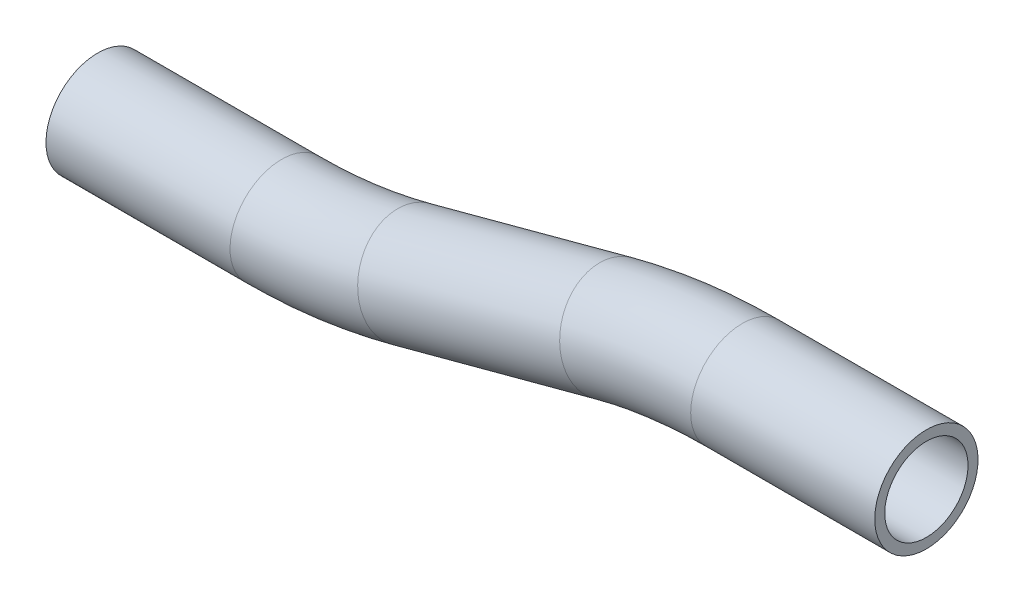
ISO-10303-21;
HEADER;
FILE_DESCRIPTION(('STEP AP214'),'2;1');
FILE_NAME('part.step','',(''),(''),'','','');
FILE_SCHEMA(('AUTOMOTIVE_DESIGN { 1 0 10303 214 1 1 1 1 }'));
ENDSEC;
DATA;
#1=APPLICATION_CONTEXT('core data for automotive mechanical design processes');
#2=APPLICATION_PROTOCOL_DEFINITION('international standard','automotive_design',2000,#1);
#3=PRODUCT_CONTEXT('',#1,'mechanical');
#4=PRODUCT('Part','Part','',(#3));
#5=PRODUCT_RELATED_PRODUCT_CATEGORY('part','',(#4));
#6=PRODUCT_DEFINITION_FORMATION('','',#4);
#7=PRODUCT_DEFINITION_CONTEXT('part definition',#1,'design');
#8=PRODUCT_DEFINITION('design','',#6,#7);
#9=PRODUCT_DEFINITION_SHAPE('','',#8);
#10=(LENGTH_UNIT() NAMED_UNIT(*) SI_UNIT(.MILLI.,.METRE.));
#11=(NAMED_UNIT(*) PLANE_ANGLE_UNIT() SI_UNIT($,.RADIAN.));
#12=(NAMED_UNIT(*) SI_UNIT($,.STERADIAN.) SOLID_ANGLE_UNIT());
#13=UNCERTAINTY_MEASURE_WITH_UNIT(LENGTH_MEASURE(1.E-05),#10,'distance_accuracy_value','');
#14=(GEOMETRIC_REPRESENTATION_CONTEXT(3) GLOBAL_UNCERTAINTY_ASSIGNED_CONTEXT((#13)) GLOBAL_UNIT_ASSIGNED_CONTEXT((#10,
#11,#12)) REPRESENTATION_CONTEXT('',''));
#15=CARTESIAN_POINT('',(0.,0.,0.));
#16=DIRECTION('',(0.,0.,1.));
#17=DIRECTION('',(1.,0.,0.));
#18=AXIS2_PLACEMENT_3D('',#15,#16,#17);
#19=CARTESIAN_POINT('',(28.0680796838404,0.,0.));
#20=DIRECTION('',(-1.,0.,0.));
#21=DIRECTION('',(0.,-1.,0.));
#22=AXIS2_PLACEMENT_3D('',#19,#20,#21);
#23=CYLINDRICAL_SURFACE('',#22,7.874);
#24=CARTESIAN_POINT('',(0.,0.,0.));
#25=DIRECTION('',(-1.,0.,0.));
#26=DIRECTION('',(0.,-1.,0.));
#27=AXIS2_PLACEMENT_3D('',#24,#25,#26);
#28=CIRCLE('',#27,7.874);
#29=CARTESIAN_POINT('',(0.,7.87399999999996,0.));
#30=VERTEX_POINT('',#29);
#31=EDGE_CURVE('E58',#30,#30,#28,.T.);
#32=ORIENTED_EDGE('',*,*,#31,.F.);
#33=EDGE_LOOP('',(#32));
#34=FACE_BOUND('',#33,.T.);
#35=CARTESIAN_POINT('',(28.0680796838404,0.,0.));
#36=DIRECTION('',(-1.,0.,0.));
#37=DIRECTION('',(0.,-1.,0.));
#38=AXIS2_PLACEMENT_3D('',#35,#36,#37);
#39=CIRCLE('',#38,7.874);
#40=CARTESIAN_POINT('',(28.0680796838404,-7.874,0.));
#41=VERTEX_POINT('',#40);
#42=EDGE_CURVE('E55',#41,#41,#39,.T.);
#43=ORIENTED_EDGE('',*,*,#42,.T.);
#44=EDGE_LOOP('',(#43));
#45=FACE_BOUND('',#44,.T.);
#46=ADVANCED_FACE('F34',(#34,#45),#23,.T.);
#47=CARTESIAN_POINT('',(0.,-76.2,0.));
#48=DIRECTION('',(0.,0.,1.));
#49=DIRECTION('',(1.,0.,0.));
#50=AXIS2_PLACEMENT_3D('',#47,#48,#49);
#51=TOROIDAL_SURFACE('',#50,76.2,7.874);
#52=CARTESIAN_POINT('',(-19.7220112368122,-2.59645203677303,0.));
#53=DIRECTION('',(-0.965925826289068,-0.258819045102522,0.));
#54=DIRECTION('',(0.258819045102522,-0.965925826289068,0.));
#55=AXIS2_PLACEMENT_3D('',#52,#53,#54);
#56=CIRCLE('',#55,7.874);
#57=CARTESIAN_POINT('',(-21.7599523979494,5.00924791942708,0.));
#58=VERTEX_POINT('',#57);
#59=EDGE_CURVE('E61',#58,#58,#56,.T.);
#60=CARTESIAN_POINT('',(0.,-76.2,0.));
#61=DIRECTION('',(0.,0.,1.));
#62=DIRECTION('',(1.,0.,0.));
#63=AXIS2_PLACEMENT_3D('',#60,#61,#62);
#64=CIRCLE('',#63,84.074);
#65=EDGE_CURVE('',#30,#58,#64,.T.);
#66=ORIENTED_EDGE('',*,*,#31,.T.);
#67=ORIENTED_EDGE('',*,*,#59,.F.);
#68=ORIENTED_EDGE('',*,*,#65,.T.);
#69=ORIENTED_EDGE('',*,*,#65,.F.);
#70=EDGE_LOOP('',(#66,#68,#67,#69));
#71=FACE_BOUND('',#70,.T.);
#72=ADVANCED_FACE('F80',(#71),#51,.T.);
#73=CARTESIAN_POINT('',(-19.7220112368122,-2.59645203677303,0.));
#74=DIRECTION('',(-0.965925826289068,-0.258819045102522,0.));
#75=DIRECTION('',(0.258819045102522,-0.965925826289068,0.));
#76=AXIS2_PLACEMENT_3D('',#73,#74,#75);
#77=CYLINDRICAL_SURFACE('',#76,7.874);
#78=CARTESIAN_POINT('',(-50.5239923613557,-10.8498180043732,0.));
#79=DIRECTION('',(-0.965925826289068,-0.258819045102522,0.));
#80=DIRECTION('',(0.258819045102522,-0.965925826289068,0.));
#81=AXIS2_PLACEMENT_3D('',#78,#79,#80);
#82=CIRCLE('',#81,7.874);
#83=CARTESIAN_POINT('',(-48.4860512002184,-18.4555179605733,0.));
#84=VERTEX_POINT('',#83);
#85=EDGE_CURVE('E63',#84,#84,#82,.T.);
#86=ORIENTED_EDGE('',*,*,#85,.F.);
#87=EDGE_LOOP('',(#86));
#88=FACE_BOUND('',#87,.T.);
#89=ORIENTED_EDGE('',*,*,#59,.T.);
#90=EDGE_LOOP('',(#89));
#91=FACE_BOUND('',#90,.T.);
#92=ADVANCED_FACE('F73',(#88,#91),#77,.T.);
#93=CARTESIAN_POINT('',(-70.2460035981678,62.7537299588538,0.));
#94=DIRECTION('',(0.,0.,-1.));
#95=DIRECTION('',(-1.,0.,0.));
#96=AXIS2_PLACEMENT_3D('',#93,#94,#95);
#97=TOROIDAL_SURFACE('',#96,76.2,7.874);
#98=CARTESIAN_POINT('',(-70.2460035981677,-13.4462700411462,0.));
#99=DIRECTION('',(-1.,0.,0.));
#100=DIRECTION('',(0.,-1.,0.));
#101=AXIS2_PLACEMENT_3D('',#98,#99,#100);
#102=CIRCLE('',#101,7.874);
#103=CARTESIAN_POINT('',(-70.2460035981677,-21.3202700411462,0.));
#104=VERTEX_POINT('',#103);
#105=EDGE_CURVE('E38',#104,#104,#102,.T.);
#106=CARTESIAN_POINT('',(-70.2460035981678,62.7537299588538,0.));
#107=DIRECTION('',(0.,0.,-1.));
#108=DIRECTION('',(-1.,0.,0.));
#109=AXIS2_PLACEMENT_3D('',#106,#107,#108);
#110=CIRCLE('',#109,84.074);
#111=EDGE_CURVE('',#84,#104,#110,.T.);
#112=ORIENTED_EDGE('',*,*,#85,.T.);
#113=ORIENTED_EDGE('',*,*,#105,.F.);
#114=ORIENTED_EDGE('',*,*,#111,.T.);
#115=ORIENTED_EDGE('',*,*,#111,.F.);
#116=EDGE_LOOP('',(#112,#114,#113,#115));
#117=FACE_BOUND('',#116,.T.);
#118=ADVANCED_FACE('F71',(#117),#97,.T.);
#119=CARTESIAN_POINT('',(-70.2460035981677,-13.4462700411462,0.));
#120=DIRECTION('',(-1.,0.,0.));
#121=DIRECTION('',(0.,-1.,0.));
#122=AXIS2_PLACEMENT_3D('',#119,#120,#121);
#123=CYLINDRICAL_SURFACE('',#122,7.874);
#124=CARTESIAN_POINT('',(-98.3140832820081,-13.4462700411462,0.));
#125=DIRECTION('',(-1.,0.,0.));
#126=DIRECTION('',(0.,-1.,0.));
#127=AXIS2_PLACEMENT_3D('',#124,#125,#126);
#128=CIRCLE('',#127,7.874);
#129=CARTESIAN_POINT('',(-98.3140832820081,-21.3202700411462,0.));
#130=VERTEX_POINT('',#129);
#131=EDGE_CURVE('E51',#130,#130,#128,.T.);
#132=ORIENTED_EDGE('',*,*,#131,.F.);
#133=EDGE_LOOP('',(#132));
#134=FACE_BOUND('',#133,.T.);
#135=ORIENTED_EDGE('',*,*,#105,.T.);
#136=EDGE_LOOP('',(#135));
#137=FACE_BOUND('',#136,.T.);
#138=ADVANCED_FACE('F36',(#134,#137),#123,.T.);
#139=CARTESIAN_POINT('',(28.0680796838404,0.,0.));
#140=DIRECTION('',(-1.,0.,0.));
#141=DIRECTION('',(0.,-1.,0.));
#142=AXIS2_PLACEMENT_3D('',#139,#140,#141);
#143=PLANE('',#142);
#144=CARTESIAN_POINT('',(28.0680796838404,0.,0.));
#145=DIRECTION('',(-1.,0.,0.));
#146=DIRECTION('',(0.,-1.,0.));
#147=AXIS2_PLACEMENT_3D('',#144,#145,#146);
#148=CIRCLE('',#147,6.35);
#149=CARTESIAN_POINT('',(28.0680796838404,-6.35,0.));
#150=VERTEX_POINT('',#149);
#151=EDGE_CURVE('E54',#150,#150,#148,.F.);
#152=ORIENTED_EDGE('',*,*,#151,.F.);
#153=EDGE_LOOP('',(#152));
#154=FACE_BOUND('',#153,.T.);
#155=ORIENTED_EDGE('',*,*,#42,.F.);
#156=EDGE_LOOP('',(#155));
#157=FACE_BOUND('',#156,.T.);
#158=ADVANCED_FACE('F78',(#154,#157),#143,.F.);
#159=CARTESIAN_POINT('',(-98.3140832820081,-13.4462700411462,0.));
#160=DIRECTION('',(-1.,0.,0.));
#161=DIRECTION('',(0.,-1.,0.));
#162=AXIS2_PLACEMENT_3D('',#159,#160,#161);
#163=PLANE('',#162);
#164=CARTESIAN_POINT('',(-98.3140832820081,-13.4462700411462,0.));
#165=DIRECTION('',(-1.,0.,0.));
#166=DIRECTION('',(0.,-1.,0.));
#167=AXIS2_PLACEMENT_3D('',#164,#165,#166);
#168=CIRCLE('',#167,6.35);
#169=CARTESIAN_POINT('',(-98.3140832820081,-19.7962700411462,0.));
#170=VERTEX_POINT('',#169);
#171=EDGE_CURVE('E10',#170,#170,#168,.F.);
#172=ORIENTED_EDGE('',*,*,#171,.T.);
#173=EDGE_LOOP('',(#172));
#174=FACE_BOUND('',#173,.T.);
#175=ORIENTED_EDGE('',*,*,#131,.T.);
#176=EDGE_LOOP('',(#175));
#177=FACE_BOUND('',#176,.T.);
#178=ADVANCED_FACE('F97',(#174,#177),#163,.T.);
#179=CARTESIAN_POINT('',(28.0680796838404,0.,0.));
#180=DIRECTION('',(-1.,0.,0.));
#181=DIRECTION('',(0.,-1.,0.));
#182=AXIS2_PLACEMENT_3D('',#179,#180,#181);
#183=CYLINDRICAL_SURFACE('',#182,6.35);
#184=CARTESIAN_POINT('',(0.,0.,0.));
#185=DIRECTION('',(-1.,0.,0.));
#186=DIRECTION('',(0.,-1.,0.));
#187=AXIS2_PLACEMENT_3D('',#184,#185,#186);
#188=CIRCLE('',#187,6.35);
#189=CARTESIAN_POINT('',(0.,6.34999999999997,0.));
#190=VERTEX_POINT('',#189);
#191=EDGE_CURVE('E195',#190,#190,#188,.F.);
#192=ORIENTED_EDGE('',*,*,#191,.F.);
#193=EDGE_LOOP('',(#192));
#194=FACE_BOUND('',#193,.T.);
#195=ORIENTED_EDGE('',*,*,#151,.T.);
#196=EDGE_LOOP('',(#195));
#197=FACE_BOUND('',#196,.T.);
#198=ADVANCED_FACE('F100',(#194,#197),#183,.F.);
#199=CARTESIAN_POINT('',(0.,-76.2,0.));
#200=DIRECTION('',(0.,0.,1.));
#201=DIRECTION('',(1.,0.,0.));
#202=AXIS2_PLACEMENT_3D('',#199,#200,#201);
#203=TOROIDAL_SURFACE('',#202,76.2,6.35);
#204=CARTESIAN_POINT('',(-19.7220112368122,-2.59645203677303,0.));
#205=DIRECTION('',(-0.965925826289068,-0.258819045102522,0.));
#206=DIRECTION('',(0.258819045102522,-0.965925826289068,0.));
#207=AXIS2_PLACEMENT_3D('',#204,#205,#206);
#208=CIRCLE('',#207,6.35);
#209=CARTESIAN_POINT('',(-21.3655121732132,3.53717696016255,0.));
#210=VERTEX_POINT('',#209);
#211=EDGE_CURVE('E194',#210,#210,#208,.F.);
#212=CARTESIAN_POINT('',(0.,-76.2,0.));
#213=DIRECTION('',(0.,0.,1.));
#214=DIRECTION('',(1.,0.,0.));
#215=AXIS2_PLACEMENT_3D('',#212,#213,#214);
#216=CIRCLE('',#215,82.55);
#217=EDGE_CURVE('',#190,#210,#216,.T.);
#218=ORIENTED_EDGE('',*,*,#191,.T.);
#219=ORIENTED_EDGE('',*,*,#211,.F.);
#220=ORIENTED_EDGE('',*,*,#217,.T.);
#221=ORIENTED_EDGE('',*,*,#217,.F.);
#222=EDGE_LOOP('',(#218,#220,#219,#221));
#223=FACE_BOUND('',#222,.T.);
#224=ADVANCED_FACE('F155',(#223),#203,.F.);
#225=CARTESIAN_POINT('',(-19.7220112368122,-2.59645203677303,0.));
#226=DIRECTION('',(-0.965925826289068,-0.258819045102522,0.));
#227=DIRECTION('',(0.258819045102522,-0.965925826289068,0.));
#228=AXIS2_PLACEMENT_3D('',#225,#226,#227);
#229=CYLINDRICAL_SURFACE('',#228,6.35);
#230=CARTESIAN_POINT('',(-50.5239923613557,-10.8498180043732,0.));
#231=DIRECTION('',(-0.965925826289068,-0.258819045102522,0.));
#232=DIRECTION('',(0.258819045102522,-0.965925826289068,0.));
#233=AXIS2_PLACEMENT_3D('',#230,#231,#232);
#234=CIRCLE('',#233,6.35);
#235=CARTESIAN_POINT('',(-48.8804914249546,-16.9834470013087,0.));
#236=VERTEX_POINT('',#235);
#237=EDGE_CURVE('E47',#236,#236,#234,.F.);
#238=ORIENTED_EDGE('',*,*,#237,.F.);
#239=EDGE_LOOP('',(#238));
#240=FACE_BOUND('',#239,.T.);
#241=ORIENTED_EDGE('',*,*,#211,.T.);
#242=EDGE_LOOP('',(#241));
#243=FACE_BOUND('',#242,.T.);
#244=ADVANCED_FACE('F91',(#240,#243),#229,.F.);
#245=CARTESIAN_POINT('',(-70.2460035981678,62.7537299588538,0.));
#246=DIRECTION('',(0.,0.,-1.));
#247=DIRECTION('',(-1.,0.,0.));
#248=AXIS2_PLACEMENT_3D('',#245,#246,#247);
#249=TOROIDAL_SURFACE('',#248,76.2,6.35);
#250=CARTESIAN_POINT('',(-70.2460035981677,-13.4462700411462,0.));
#251=DIRECTION('',(-1.,0.,0.));
#252=DIRECTION('',(0.,-1.,0.));
#253=AXIS2_PLACEMENT_3D('',#250,#251,#252);
#254=CIRCLE('',#253,6.35);
#255=CARTESIAN_POINT('',(-70.2460035981677,-19.7962700411462,0.));
#256=VERTEX_POINT('',#255);
#257=EDGE_CURVE('E42',#256,#256,#254,.F.);
#258=CARTESIAN_POINT('',(-70.2460035981678,62.7537299588538,0.));
#259=DIRECTION('',(0.,0.,-1.));
#260=DIRECTION('',(-1.,0.,0.));
#261=AXIS2_PLACEMENT_3D('',#258,#259,#260);
#262=CIRCLE('',#261,82.55);
#263=EDGE_CURVE('',#236,#256,#262,.T.);
#264=ORIENTED_EDGE('',*,*,#237,.T.);
#265=ORIENTED_EDGE('',*,*,#257,.F.);
#266=ORIENTED_EDGE('',*,*,#263,.T.);
#267=ORIENTED_EDGE('',*,*,#263,.F.);
#268=EDGE_LOOP('',(#264,#266,#265,#267));
#269=FACE_BOUND('',#268,.T.);
#270=ADVANCED_FACE('F85',(#269),#249,.F.);
#271=CARTESIAN_POINT('',(-70.2460035981677,-13.4462700411462,0.));
#272=DIRECTION('',(-1.,0.,0.));
#273=DIRECTION('',(0.,-1.,0.));
#274=AXIS2_PLACEMENT_3D('',#271,#272,#273);
#275=CYLINDRICAL_SURFACE('',#274,6.35);
#276=ORIENTED_EDGE('',*,*,#171,.F.);
#277=EDGE_LOOP('',(#276));
#278=FACE_BOUND('',#277,.T.);
#279=ORIENTED_EDGE('',*,*,#257,.T.);
#280=EDGE_LOOP('',(#279));
#281=FACE_BOUND('',#280,.T.);
#282=ADVANCED_FACE('F83',(#278,#281),#275,.F.);
#283=CLOSED_SHELL('',(#46,#72,#92,#118,#138,#158,#178,#198,#224,#244,#270,#282));
#284=MANIFOLD_SOLID_BREP('B2',#283);
#285=ADVANCED_BREP_SHAPE_REPRESENTATION('',(#18,#284),#14);
#286=SHAPE_DEFINITION_REPRESENTATION(#9,#285);
ENDSEC;
END-ISO-10303-21;
